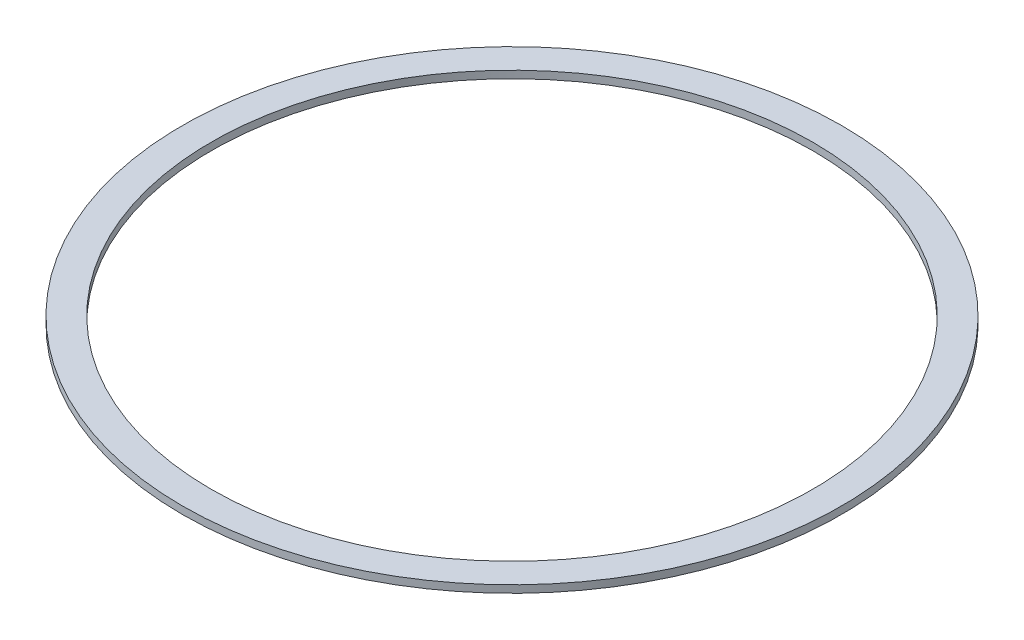
ISO-10303-21;
HEADER;
FILE_DESCRIPTION(('STEP AP214'),'2;1');
FILE_NAME('part.step','',(''),(''),'','','');
FILE_SCHEMA(('AUTOMOTIVE_DESIGN { 1 0 10303 214 1 1 1 1 }'));
ENDSEC;
DATA;
#1=APPLICATION_CONTEXT('core data for automotive mechanical design processes');
#2=APPLICATION_PROTOCOL_DEFINITION('international standard','automotive_design',2000,#1);
#3=PRODUCT_CONTEXT('',#1,'mechanical');
#4=PRODUCT('Part','Part','',(#3));
#5=PRODUCT_RELATED_PRODUCT_CATEGORY('part','',(#4));
#6=PRODUCT_DEFINITION_FORMATION('','',#4);
#7=PRODUCT_DEFINITION_CONTEXT('part definition',#1,'design');
#8=PRODUCT_DEFINITION('design','',#6,#7);
#9=PRODUCT_DEFINITION_SHAPE('','',#8);
#10=(LENGTH_UNIT() NAMED_UNIT(*) SI_UNIT(.MILLI.,.METRE.));
#11=(NAMED_UNIT(*) PLANE_ANGLE_UNIT() SI_UNIT($,.RADIAN.));
#12=(NAMED_UNIT(*) SI_UNIT($,.STERADIAN.) SOLID_ANGLE_UNIT());
#13=UNCERTAINTY_MEASURE_WITH_UNIT(LENGTH_MEASURE(1.E-05),#10,'distance_accuracy_value','');
#14=(GEOMETRIC_REPRESENTATION_CONTEXT(3) GLOBAL_UNCERTAINTY_ASSIGNED_CONTEXT((#13)) GLOBAL_UNIT_ASSIGNED_CONTEXT((#10,
#11,#12)) REPRESENTATION_CONTEXT('',''));
#15=CARTESIAN_POINT('',(0.,0.,0.));
#16=DIRECTION('',(0.,0.,1.));
#17=DIRECTION('',(1.,0.,0.));
#18=AXIS2_PLACEMENT_3D('',#15,#16,#17);
#19=CARTESIAN_POINT('',(0.,1.8,0.));
#20=DIRECTION('',(0.,1.,0.));
#21=DIRECTION('',(0.,0.,1.));
#22=AXIS2_PLACEMENT_3D('',#19,#20,#21);
#23=PLANE('',#22);
#24=CARTESIAN_POINT('',(0.,1.8,0.));
#25=DIRECTION('',(0.,1.,0.));
#26=DIRECTION('',(0.,0.,1.));
#27=AXIS2_PLACEMENT_3D('',#24,#25,#26);
#28=CIRCLE('',#27,80.);
#29=CARTESIAN_POINT('',(0.,1.8,80.));
#30=VERTEX_POINT('',#29);
#31=EDGE_CURVE('E10',#30,#30,#28,.T.);
#32=ORIENTED_EDGE('',*,*,#31,.T.);
#33=EDGE_LOOP('',(#32));
#34=FACE_BOUND('',#33,.T.);
#35=CARTESIAN_POINT('',(0.,1.8,0.));
#36=DIRECTION('',(0.,1.,0.));
#37=DIRECTION('',(0.,0.,1.));
#38=AXIS2_PLACEMENT_3D('',#35,#36,#37);
#39=CIRCLE('',#38,73.);
#40=CARTESIAN_POINT('',(0.,1.8,73.));
#41=VERTEX_POINT('',#40);
#42=EDGE_CURVE('E52',#41,#41,#39,.T.);
#43=ORIENTED_EDGE('',*,*,#42,.F.);
#44=EDGE_LOOP('',(#43));
#45=FACE_BOUND('',#44,.T.);
#46=ADVANCED_FACE('F39',(#34,#45),#23,.T.);
#47=CARTESIAN_POINT('',(0.,0.,0.));
#48=DIRECTION('',(0.,1.,0.));
#49=DIRECTION('',(0.,0.,1.));
#50=AXIS2_PLACEMENT_3D('',#47,#48,#49);
#51=PLANE('',#50);
#52=CARTESIAN_POINT('',(0.,0.,0.));
#53=DIRECTION('',(0.,1.,0.));
#54=DIRECTION('',(0.,0.,1.));
#55=AXIS2_PLACEMENT_3D('',#52,#53,#54);
#56=CIRCLE('',#55,80.);
#57=CARTESIAN_POINT('',(0.,0.,80.));
#58=VERTEX_POINT('',#57);
#59=EDGE_CURVE('E43',#58,#58,#56,.T.);
#60=ORIENTED_EDGE('',*,*,#59,.F.);
#61=EDGE_LOOP('',(#60));
#62=FACE_BOUND('',#61,.T.);
#63=CARTESIAN_POINT('',(0.,0.,0.));
#64=DIRECTION('',(0.,1.,0.));
#65=DIRECTION('',(0.,0.,1.));
#66=AXIS2_PLACEMENT_3D('',#63,#64,#65);
#67=CIRCLE('',#66,73.);
#68=CARTESIAN_POINT('',(0.,0.,73.));
#69=VERTEX_POINT('',#68);
#70=EDGE_CURVE('E54',#69,#69,#67,.T.);
#71=ORIENTED_EDGE('',*,*,#70,.T.);
#72=EDGE_LOOP('',(#71));
#73=FACE_BOUND('',#72,.T.);
#74=ADVANCED_FACE('F66',(#62,#73),#51,.F.);
#75=CARTESIAN_POINT('',(0.,1.8,0.));
#76=DIRECTION('',(0.,-1.,0.));
#77=DIRECTION('',(0.,0.,-1.));
#78=AXIS2_PLACEMENT_3D('',#75,#76,#77);
#79=CYLINDRICAL_SURFACE('',#78,80.);
#80=ORIENTED_EDGE('',*,*,#31,.F.);
#81=EDGE_LOOP('',(#80));
#82=FACE_BOUND('',#81,.T.);
#83=ORIENTED_EDGE('',*,*,#59,.T.);
#84=EDGE_LOOP('',(#83));
#85=FACE_BOUND('',#84,.T.);
#86=ADVANCED_FACE('F41',(#82,#85),#79,.T.);
#87=CARTESIAN_POINT('',(0.,1.8,0.));
#88=DIRECTION('',(0.,-1.,0.));
#89=DIRECTION('',(0.,0.,-1.));
#90=AXIS2_PLACEMENT_3D('',#87,#88,#89);
#91=CYLINDRICAL_SURFACE('',#90,73.);
#92=ORIENTED_EDGE('',*,*,#42,.T.);
#93=EDGE_LOOP('',(#92));
#94=FACE_BOUND('',#93,.T.);
#95=ORIENTED_EDGE('',*,*,#70,.F.);
#96=EDGE_LOOP('',(#95));
#97=FACE_BOUND('',#96,.T.);
#98=ADVANCED_FACE('F62',(#94,#97),#91,.F.);
#99=CLOSED_SHELL('',(#46,#74,#86,#98));
#100=MANIFOLD_SOLID_BREP('B2',#99);
#101=ADVANCED_BREP_SHAPE_REPRESENTATION('',(#18,#100),#14);
#102=SHAPE_DEFINITION_REPRESENTATION(#9,#101);
ENDSEC;
END-ISO-10303-21;
